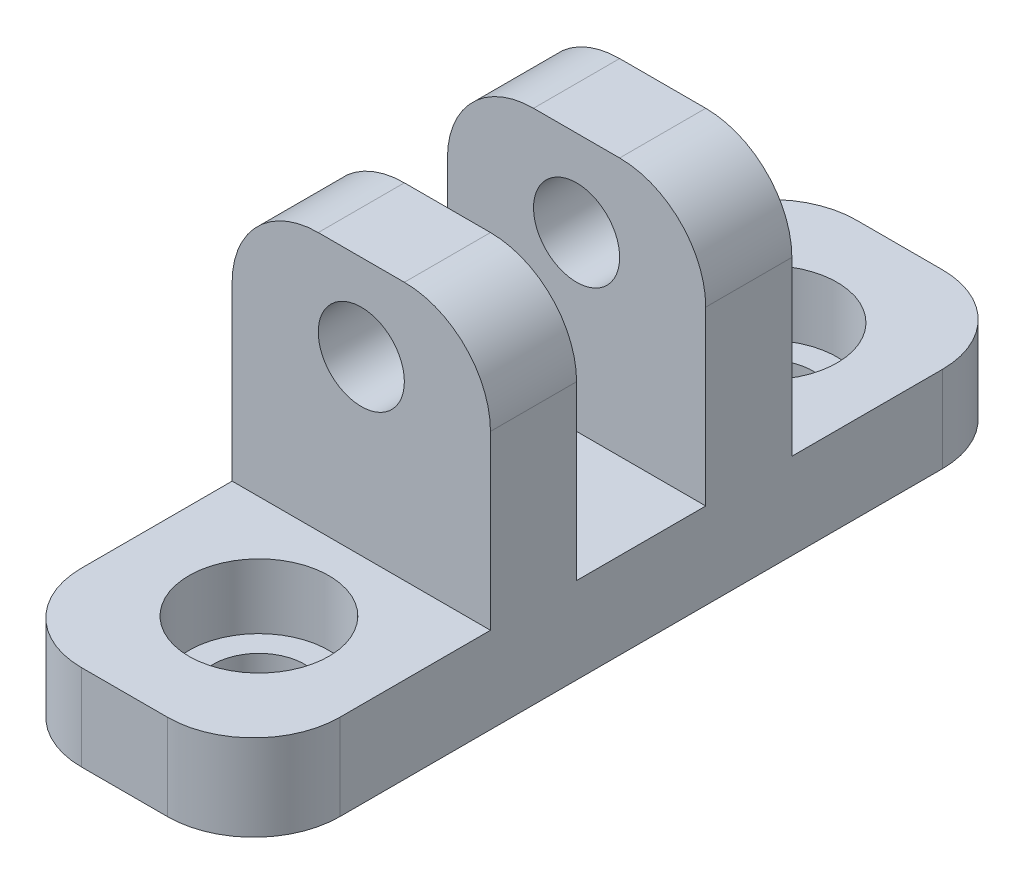
ISO-10303-21;
HEADER;
FILE_DESCRIPTION(('STEP AP214'),'2;1');
FILE_NAME('part.step','',(''),(''),'','','');
FILE_SCHEMA(('AUTOMOTIVE_DESIGN { 1 0 10303 214 1 1 1 1 }'));
ENDSEC;
DATA;
#1=APPLICATION_CONTEXT('core data for automotive mechanical design processes');
#2=APPLICATION_PROTOCOL_DEFINITION('international standard','automotive_design',2000,#1);
#3=PRODUCT_CONTEXT('',#1,'mechanical');
#4=PRODUCT('Part','Part','',(#3));
#5=PRODUCT_RELATED_PRODUCT_CATEGORY('part','',(#4));
#6=PRODUCT_DEFINITION_FORMATION('','',#4);
#7=PRODUCT_DEFINITION_CONTEXT('part definition',#1,'design');
#8=PRODUCT_DEFINITION('design','',#6,#7);
#9=PRODUCT_DEFINITION_SHAPE('','',#8);
#10=(LENGTH_UNIT() NAMED_UNIT(*) SI_UNIT(.MILLI.,.METRE.));
#11=(NAMED_UNIT(*) PLANE_ANGLE_UNIT() SI_UNIT($,.RADIAN.));
#12=(NAMED_UNIT(*) SI_UNIT($,.STERADIAN.) SOLID_ANGLE_UNIT());
#13=UNCERTAINTY_MEASURE_WITH_UNIT(LENGTH_MEASURE(1.E-05),#10,'distance_accuracy_value','');
#14=(GEOMETRIC_REPRESENTATION_CONTEXT(3) GLOBAL_UNCERTAINTY_ASSIGNED_CONTEXT((#13)) GLOBAL_UNIT_ASSIGNED_CONTEXT((#10,
#11,#12)) REPRESENTATION_CONTEXT('',''));
#15=CARTESIAN_POINT('',(0.,0.,0.));
#16=DIRECTION('',(0.,0.,1.));
#17=DIRECTION('',(1.,0.,0.));
#18=AXIS2_PLACEMENT_3D('',#15,#16,#17);
#19=CARTESIAN_POINT('',(60.325,6.35,-28.575));
#20=DIRECTION('',(0.,-1.,0.));
#21=DIRECTION('',(0.,0.,-1.));
#22=AXIS2_PLACEMENT_3D('',#19,#20,#21);
#23=PLANE('',#22);
#24=DIRECTION('',(1.,0.,0.));
#25=VECTOR('',#24,1.);
#26=CARTESIAN_POINT('',(60.325,6.35,-28.575));
#27=LINE('',#26,#25);
#28=CARTESIAN_POINT('',(66.675,6.35,-28.575));
#29=VERTEX_POINT('',#28);
#30=CARTESIAN_POINT('',(73.025,6.35,-28.575));
#31=VERTEX_POINT('',#30);
#32=EDGE_CURVE('E258',#29,#31,#27,.T.);
#33=ORIENTED_EDGE('',*,*,#32,.F.);
#34=CARTESIAN_POINT('',(66.675,6.35,-22.225));
#35=DIRECTION('',(0.,-1.,0.));
#36=DIRECTION('',(0.,0.,-1.));
#37=AXIS2_PLACEMENT_3D('',#34,#35,#36);
#38=CIRCLE('',#37,6.35);
#39=CARTESIAN_POINT('',(60.325,6.35,-22.225));
#40=VERTEX_POINT('',#39);
#41=EDGE_CURVE('E378',#29,#40,#38,.F.);
#42=ORIENTED_EDGE('',*,*,#41,.T.);
#43=DIRECTION('',(0.,0.,-1.));
#44=VECTOR('',#43,1.);
#45=CARTESIAN_POINT('',(60.325,6.35,-28.575));
#46=LINE('',#45,#44);
#47=CARTESIAN_POINT('',(60.325,6.35,-11.1125));
#48=VERTEX_POINT('',#47);
#49=EDGE_CURVE('E278',#48,#40,#46,.T.);
#50=ORIENTED_EDGE('',*,*,#49,.F.);
#51=DIRECTION('',(1.,0.,0.));
#52=VECTOR('',#51,1.);
#53=CARTESIAN_POINT('',(60.325,6.35,-11.1125));
#54=LINE('',#53,#52);
#55=CARTESIAN_POINT('',(79.375,6.35,-11.1125));
#56=VERTEX_POINT('',#55);
#57=EDGE_CURVE('E293',#48,#56,#54,.T.);
#58=ORIENTED_EDGE('',*,*,#57,.T.);
#59=DIRECTION('',(0.,0.,-1.));
#60=VECTOR('',#59,1.);
#61=CARTESIAN_POINT('',(79.375,6.35,-28.575));
#62=LINE('',#61,#60);
#63=CARTESIAN_POINT('',(79.375,6.35,-22.225));
#64=VERTEX_POINT('',#63);
#65=EDGE_CURVE('E279',#56,#64,#62,.T.);
#66=ORIENTED_EDGE('',*,*,#65,.T.);
#67=CARTESIAN_POINT('',(73.025,6.35,-22.225));
#68=DIRECTION('',(0.,-1.,0.));
#69=DIRECTION('',(0.,0.,-1.));
#70=AXIS2_PLACEMENT_3D('',#67,#68,#69);
#71=CIRCLE('',#70,6.35);
#72=EDGE_CURVE('E375',#64,#31,#71,.F.);
#73=ORIENTED_EDGE('',*,*,#72,.T.);
#74=EDGE_LOOP('',(#33,#42,#50,#58,#66,#73));
#75=FACE_BOUND('',#74,.T.);
#76=CARTESIAN_POINT('',(69.9233705650656,6.35,-18.7359106749715));
#77=DIRECTION('',(0.,1.,0.));
#78=DIRECTION('',(0.,0.,1.));
#79=AXIS2_PLACEMENT_3D('',#76,#77,#78);
#80=CIRCLE('',#79,5.15873999999999);
#81=CARTESIAN_POINT('',(69.9233705650656,6.35,-13.5771706749715));
#82=VERTEX_POINT('',#81);
#83=EDGE_CURVE('E797',#82,#82,#80,.T.);
#84=ORIENTED_EDGE('',*,*,#83,.F.);
#85=EDGE_LOOP('',(#84));
#86=FACE_BOUND('',#85,.T.);
#87=ADVANCED_FACE('F41',(#75,#86),#23,.F.);
#88=CARTESIAN_POINT('',(60.325,6.35,28.575));
#89=DIRECTION('',(0.,-1.,0.));
#90=DIRECTION('',(0.,0.,-1.));
#91=AXIS2_PLACEMENT_3D('',#88,#89,#90);
#92=PLANE('',#91);
#93=DIRECTION('',(0.,0.,-1.));
#94=VECTOR('',#93,1.);
#95=CARTESIAN_POINT('',(60.325,6.35,28.575));
#96=LINE('',#95,#94);
#97=CARTESIAN_POINT('',(60.325,6.35,22.225));
#98=VERTEX_POINT('',#97);
#99=CARTESIAN_POINT('',(60.325,6.35,11.1125));
#100=VERTEX_POINT('',#99);
#101=EDGE_CURVE('E300',#98,#100,#96,.T.);
#102=ORIENTED_EDGE('',*,*,#101,.F.);
#103=CARTESIAN_POINT('',(66.675,6.35,22.225));
#104=DIRECTION('',(0.,-1.,0.));
#105=DIRECTION('',(0.,0.,-1.));
#106=AXIS2_PLACEMENT_3D('',#103,#104,#105);
#107=CIRCLE('',#106,6.35);
#108=CARTESIAN_POINT('',(66.675,6.35,28.575));
#109=VERTEX_POINT('',#108);
#110=EDGE_CURVE('E404',#98,#109,#107,.F.);
#111=ORIENTED_EDGE('',*,*,#110,.T.);
#112=DIRECTION('',(1.,0.,0.));
#113=VECTOR('',#112,1.);
#114=CARTESIAN_POINT('',(60.325,6.35,28.575));
#115=LINE('',#114,#113);
#116=CARTESIAN_POINT('',(73.025,6.35,28.575));
#117=VERTEX_POINT('',#116);
#118=EDGE_CURVE('E307',#109,#117,#115,.T.);
#119=ORIENTED_EDGE('',*,*,#118,.T.);
#120=CARTESIAN_POINT('',(73.025,6.35,22.225));
#121=DIRECTION('',(0.,-1.,0.));
#122=DIRECTION('',(0.,0.,-1.));
#123=AXIS2_PLACEMENT_3D('',#120,#121,#122);
#124=CIRCLE('',#123,6.35);
#125=CARTESIAN_POINT('',(79.375,6.35,22.225));
#126=VERTEX_POINT('',#125);
#127=EDGE_CURVE('E401',#117,#126,#124,.F.);
#128=ORIENTED_EDGE('',*,*,#127,.T.);
#129=DIRECTION('',(0.,0.,-1.));
#130=VECTOR('',#129,1.);
#131=CARTESIAN_POINT('',(79.375,6.35,28.575));
#132=LINE('',#131,#130);
#133=CARTESIAN_POINT('',(79.375,6.35,11.1125));
#134=VERTEX_POINT('',#133);
#135=EDGE_CURVE('E268',#126,#134,#132,.T.);
#136=ORIENTED_EDGE('',*,*,#135,.T.);
#137=DIRECTION('',(1.,0.,0.));
#138=VECTOR('',#137,1.);
#139=CARTESIAN_POINT('',(60.325,6.35,11.1125));
#140=LINE('',#139,#138);
#141=EDGE_CURVE('E316',#100,#134,#140,.T.);
#142=ORIENTED_EDGE('',*,*,#141,.F.);
#143=EDGE_LOOP('',(#102,#111,#119,#128,#136,#142));
#144=FACE_BOUND('',#143,.T.);
#145=CARTESIAN_POINT('',(69.9233705650656,6.35,18.7359106749715));
#146=DIRECTION('',(0.,1.,0.));
#147=DIRECTION('',(0.,0.,1.));
#148=AXIS2_PLACEMENT_3D('',#145,#146,#147);
#149=CIRCLE('',#148,5.15873999999999);
#150=CARTESIAN_POINT('',(69.9233705650656,6.35,23.8946506749715));
#151=VERTEX_POINT('',#150);
#152=EDGE_CURVE('E563',#151,#151,#149,.T.);
#153=ORIENTED_EDGE('',*,*,#152,.F.);
#154=EDGE_LOOP('',(#153));
#155=FACE_BOUND('',#154,.T.);
#156=ADVANCED_FACE('F464',(#144,#155),#92,.F.);
#157=CARTESIAN_POINT('',(0.,25.4,0.));
#158=DIRECTION('',(0.,1.,0.));
#159=DIRECTION('',(0.,0.,1.));
#160=AXIS2_PLACEMENT_3D('',#157,#158,#159);
#161=PLANE('',#160);
#162=DIRECTION('',(1.,0.,0.));
#163=VECTOR('',#162,1.);
#164=CARTESIAN_POINT('',(60.325,25.4,4.76249999999999));
#165=LINE('',#164,#163);
#166=CARTESIAN_POINT('',(66.675,25.4,4.76249999999999));
#167=VERTEX_POINT('',#166);
#168=CARTESIAN_POINT('',(73.025,25.4,4.76249999999999));
#169=VERTEX_POINT('',#168);
#170=EDGE_CURVE('E264',#167,#169,#165,.T.);
#171=ORIENTED_EDGE('',*,*,#170,.F.);
#172=DIRECTION('',(0.,0.,1.));
#173=VECTOR('',#172,1.);
#174=CARTESIAN_POINT('',(66.675,25.4,11.1125));
#175=LINE('',#174,#173);
#176=CARTESIAN_POINT('',(66.675,25.4,11.1125));
#177=VERTEX_POINT('',#176);
#178=EDGE_CURVE('E431',#167,#177,#175,.T.);
#179=ORIENTED_EDGE('',*,*,#178,.T.);
#180=DIRECTION('',(1.,0.,0.));
#181=VECTOR('',#180,1.);
#182=CARTESIAN_POINT('',(60.325,25.4,11.1125));
#183=LINE('',#182,#181);
#184=CARTESIAN_POINT('',(73.025,25.4,11.1125));
#185=VERTEX_POINT('',#184);
#186=EDGE_CURVE('E312',#177,#185,#183,.T.);
#187=ORIENTED_EDGE('',*,*,#186,.T.);
#188=DIRECTION('',(0.,0.,-1.));
#189=VECTOR('',#188,1.);
#190=CARTESIAN_POINT('',(73.025,25.4,4.76249999999999));
#191=LINE('',#190,#189);
#192=EDGE_CURVE('E427',#185,#169,#191,.T.);
#193=ORIENTED_EDGE('',*,*,#192,.T.);
#194=EDGE_LOOP('',(#171,#179,#187,#193));
#195=FACE_BOUND('',#194,.T.);
#196=ADVANCED_FACE('F447',(#195),#161,.T.);
#197=CARTESIAN_POINT('',(60.325,25.4,-28.575));
#198=DIRECTION('',(1.,0.,0.));
#199=DIRECTION('',(0.,0.,-1.));
#200=AXIS2_PLACEMENT_3D('',#197,#198,#199);
#201=PLANE('',#200);
#202=ORIENTED_EDGE('',*,*,#49,.T.);
#203=DIRECTION('',(0.,-1.,0.));
#204=VECTOR('',#203,1.);
#205=CARTESIAN_POINT('',(60.325,25.4,-22.225));
#206=LINE('',#205,#204);
#207=CARTESIAN_POINT('',(60.325,0.,-22.225));
#208=VERTEX_POINT('',#207);
#209=EDGE_CURVE('E352',#40,#208,#206,.T.);
#210=ORIENTED_EDGE('',*,*,#209,.T.);
#211=DIRECTION('',(0.,0.,1.));
#212=VECTOR('',#211,1.);
#213=CARTESIAN_POINT('',(60.325,0.,-28.575));
#214=LINE('',#213,#212);
#215=CARTESIAN_POINT('',(60.325,0.,22.225));
#216=VERTEX_POINT('',#215);
#217=EDGE_CURVE('E315',#208,#216,#214,.T.);
#218=ORIENTED_EDGE('',*,*,#217,.T.);
#219=DIRECTION('',(0.,-1.,0.));
#220=VECTOR('',#219,1.);
#221=CARTESIAN_POINT('',(60.325,25.4,22.225));
#222=LINE('',#221,#220);
#223=EDGE_CURVE('E349',#216,#98,#222,.F.);
#224=ORIENTED_EDGE('',*,*,#223,.T.);
#225=ORIENTED_EDGE('',*,*,#101,.T.);
#226=DIRECTION('',(0.,1.,0.));
#227=VECTOR('',#226,1.);
#228=CARTESIAN_POINT('',(60.325,25.4,11.1125));
#229=LINE('',#228,#227);
#230=CARTESIAN_POINT('',(60.325,19.05,11.1125));
#231=VERTEX_POINT('',#230);
#232=EDGE_CURVE('E303',#100,#231,#229,.T.);
#233=ORIENTED_EDGE('',*,*,#232,.T.);
#234=DIRECTION('',(0.,0.,1.));
#235=VECTOR('',#234,1.);
#236=CARTESIAN_POINT('',(60.325,19.05,4.76249999999999));
#237=LINE('',#236,#235);
#238=CARTESIAN_POINT('',(60.325,19.05,4.7625));
#239=VERTEX_POINT('',#238);
#240=EDGE_CURVE('E229',#231,#239,#237,.F.);
#241=ORIENTED_EDGE('',*,*,#240,.T.);
#242=DIRECTION('',(0.,-1.,0.));
#243=VECTOR('',#242,1.);
#244=CARTESIAN_POINT('',(60.325,25.4,4.76249999999999));
#245=LINE('',#244,#243);
#246=CARTESIAN_POINT('',(60.325,6.35,4.76250000000004));
#247=VERTEX_POINT('',#246);
#248=EDGE_CURVE('E221',#239,#247,#245,.T.);
#249=ORIENTED_EDGE('',*,*,#248,.T.);
#250=DIRECTION('',(0.,0.,-1.));
#251=VECTOR('',#250,1.);
#252=CARTESIAN_POINT('',(60.325,6.35,4.76250000000004));
#253=LINE('',#252,#251);
#254=CARTESIAN_POINT('',(60.325,6.35,-4.76249999999996));
#255=VERTEX_POINT('',#254);
#256=EDGE_CURVE('E227',#247,#255,#253,.T.);
#257=ORIENTED_EDGE('',*,*,#256,.T.);
#258=DIRECTION('',(0.,1.,0.));
#259=VECTOR('',#258,1.);
#260=CARTESIAN_POINT('',(60.325,25.4,-4.76250000000001));
#261=LINE('',#260,#259);
#262=CARTESIAN_POINT('',(60.325,19.05,-4.76249999999999));
#263=VERTEX_POINT('',#262);
#264=EDGE_CURVE('E245',#255,#263,#261,.T.);
#265=ORIENTED_EDGE('',*,*,#264,.T.);
#266=DIRECTION('',(0.,0.,1.));
#267=VECTOR('',#266,1.);
#268=CARTESIAN_POINT('',(60.325,19.05,-11.1125));
#269=LINE('',#268,#267);
#270=CARTESIAN_POINT('',(60.325,19.05,-11.1125));
#271=VERTEX_POINT('',#270);
#272=EDGE_CURVE('E346',#263,#271,#269,.F.);
#273=ORIENTED_EDGE('',*,*,#272,.T.);
#274=DIRECTION('',(0.,-1.,0.));
#275=VECTOR('',#274,1.);
#276=CARTESIAN_POINT('',(60.325,25.4,-11.1125));
#277=LINE('',#276,#275);
#278=EDGE_CURVE('E275',#271,#48,#277,.T.);
#279=ORIENTED_EDGE('',*,*,#278,.T.);
#280=EDGE_LOOP('',(#202,#210,#218,#224,#225,#233,#241,#249,#257,#265,#273,#279));
#281=FACE_BOUND('',#280,.T.);
#282=ADVANCED_FACE('F224',(#281),#201,.F.);
#283=CARTESIAN_POINT('',(60.325,25.4,28.575));
#284=DIRECTION('',(0.,0.,-1.));
#285=DIRECTION('',(-1.,0.,0.));
#286=AXIS2_PLACEMENT_3D('',#283,#284,#285);
#287=PLANE('',#286);
#288=ORIENTED_EDGE('',*,*,#118,.F.);
#289=DIRECTION('',(0.,-1.,0.));
#290=VECTOR('',#289,1.);
#291=CARTESIAN_POINT('',(66.675,25.4,28.575));
#292=LINE('',#291,#290);
#293=CARTESIAN_POINT('',(66.675,0.,28.575));
#294=VERTEX_POINT('',#293);
#295=EDGE_CURVE('E397',#109,#294,#292,.T.);
#296=ORIENTED_EDGE('',*,*,#295,.T.);
#297=DIRECTION('',(1.,0.,0.));
#298=VECTOR('',#297,1.);
#299=CARTESIAN_POINT('',(60.325,0.,28.575));
#300=LINE('',#299,#298);
#301=CARTESIAN_POINT('',(73.025,0.,28.575));
#302=VERTEX_POINT('',#301);
#303=EDGE_CURVE('E326',#294,#302,#300,.T.);
#304=ORIENTED_EDGE('',*,*,#303,.T.);
#305=DIRECTION('',(0.,-1.,0.));
#306=VECTOR('',#305,1.);
#307=CARTESIAN_POINT('',(73.025,25.4,28.575));
#308=LINE('',#307,#306);
#309=EDGE_CURVE('E394',#302,#117,#308,.F.);
#310=ORIENTED_EDGE('',*,*,#309,.T.);
#311=EDGE_LOOP('',(#288,#296,#304,#310));
#312=FACE_BOUND('',#311,.T.);
#313=ADVANCED_FACE('F498',(#312),#287,.F.);
#314=CARTESIAN_POINT('',(79.375,25.4,-28.575));
#315=DIRECTION('',(-1.,0.,0.));
#316=DIRECTION('',(0.,0.,1.));
#317=AXIS2_PLACEMENT_3D('',#314,#315,#316);
#318=PLANE('',#317);
#319=DIRECTION('',(0.,0.,-1.));
#320=VECTOR('',#319,1.);
#321=CARTESIAN_POINT('',(79.375,0.,-28.575));
#322=LINE('',#321,#320);
#323=CARTESIAN_POINT('',(79.375,0.,22.225));
#324=VERTEX_POINT('',#323);
#325=CARTESIAN_POINT('',(79.375,0.,-22.225));
#326=VERTEX_POINT('',#325);
#327=EDGE_CURVE('E330',#324,#326,#322,.T.);
#328=ORIENTED_EDGE('',*,*,#327,.T.);
#329=DIRECTION('',(0.,-1.,0.));
#330=VECTOR('',#329,1.);
#331=CARTESIAN_POINT('',(79.375,25.4,-22.225));
#332=LINE('',#331,#330);
#333=EDGE_CURVE('E391',#326,#64,#332,.F.);
#334=ORIENTED_EDGE('',*,*,#333,.T.);
#335=ORIENTED_EDGE('',*,*,#65,.F.);
#336=DIRECTION('',(0.,-1.,0.));
#337=VECTOR('',#336,1.);
#338=CARTESIAN_POINT('',(79.375,25.4,-11.1125));
#339=LINE('',#338,#337);
#340=CARTESIAN_POINT('',(79.375,19.05,-11.1125));
#341=VERTEX_POINT('',#340);
#342=EDGE_CURVE('E283',#341,#56,#339,.T.);
#343=ORIENTED_EDGE('',*,*,#342,.F.);
#344=DIRECTION('',(0.,0.,-1.));
#345=VECTOR('',#344,1.);
#346=CARTESIAN_POINT('',(79.375,19.05,-4.76250000000001));
#347=LINE('',#346,#345);
#348=CARTESIAN_POINT('',(79.375,19.05,-4.76249999999999));
#349=VERTEX_POINT('',#348);
#350=EDGE_CURVE('E384',#341,#349,#347,.F.);
#351=ORIENTED_EDGE('',*,*,#350,.T.);
#352=DIRECTION('',(0.,1.,0.));
#353=VECTOR('',#352,1.);
#354=CARTESIAN_POINT('',(79.375,25.4,-4.76250000000001));
#355=LINE('',#354,#353);
#356=CARTESIAN_POINT('',(79.375,6.35,-4.76249999999996));
#357=VERTEX_POINT('',#356);
#358=EDGE_CURVE('E233',#357,#349,#355,.T.);
#359=ORIENTED_EDGE('',*,*,#358,.F.);
#360=DIRECTION('',(0.,0.,-1.));
#361=VECTOR('',#360,1.);
#362=CARTESIAN_POINT('',(79.375,6.35,4.76250000000004));
#363=LINE('',#362,#361);
#364=CARTESIAN_POINT('',(79.375,6.35,4.76250000000004));
#365=VERTEX_POINT('',#364);
#366=EDGE_CURVE('E257',#365,#357,#363,.T.);
#367=ORIENTED_EDGE('',*,*,#366,.F.);
#368=DIRECTION('',(0.,-1.,0.));
#369=VECTOR('',#368,1.);
#370=CARTESIAN_POINT('',(79.375,25.4,4.76249999999999));
#371=LINE('',#370,#369);
#372=CARTESIAN_POINT('',(79.375,19.05,4.7625));
#373=VERTEX_POINT('',#372);
#374=EDGE_CURVE('E239',#373,#365,#371,.T.);
#375=ORIENTED_EDGE('',*,*,#374,.F.);
#376=DIRECTION('',(0.,0.,-1.));
#377=VECTOR('',#376,1.);
#378=CARTESIAN_POINT('',(79.375,19.05,11.1125));
#379=LINE('',#378,#377);
#380=CARTESIAN_POINT('',(79.375,19.05,11.1125));
#381=VERTEX_POINT('',#380);
#382=EDGE_CURVE('E381',#373,#381,#379,.F.);
#383=ORIENTED_EDGE('',*,*,#382,.T.);
#384=DIRECTION('',(0.,1.,0.));
#385=VECTOR('',#384,1.);
#386=CARTESIAN_POINT('',(79.375,25.4,11.1125));
#387=LINE('',#386,#385);
#388=EDGE_CURVE('E304',#134,#381,#387,.T.);
#389=ORIENTED_EDGE('',*,*,#388,.F.);
#390=ORIENTED_EDGE('',*,*,#135,.F.);
#391=DIRECTION('',(0.,-1.,0.));
#392=VECTOR('',#391,1.);
#393=CARTESIAN_POINT('',(79.375,25.4,22.225));
#394=LINE('',#393,#392);
#395=EDGE_CURVE('E387',#126,#324,#394,.T.);
#396=ORIENTED_EDGE('',*,*,#395,.T.);
#397=EDGE_LOOP('',(#328,#334,#335,#343,#351,#359,#367,#375,#383,#389,#390,#396));
#398=FACE_BOUND('',#397,.T.);
#399=ADVANCED_FACE('F443',(#398),#318,.F.);
#400=CARTESIAN_POINT('',(60.325,25.4,-28.575));
#401=DIRECTION('',(0.,0.,1.));
#402=DIRECTION('',(1.,0.,0.));
#403=AXIS2_PLACEMENT_3D('',#400,#401,#402);
#404=PLANE('',#403);
#405=DIRECTION('',(-1.,0.,0.));
#406=VECTOR('',#405,1.);
#407=CARTESIAN_POINT('',(60.325,0.,-28.575));
#408=LINE('',#407,#406);
#409=CARTESIAN_POINT('',(73.025,0.,-28.575));
#410=VERTEX_POINT('',#409);
#411=CARTESIAN_POINT('',(66.675,0.,-28.575));
#412=VERTEX_POINT('',#411);
#413=EDGE_CURVE('E334',#410,#412,#408,.T.);
#414=ORIENTED_EDGE('',*,*,#413,.T.);
#415=DIRECTION('',(0.,-1.,0.));
#416=VECTOR('',#415,1.);
#417=CARTESIAN_POINT('',(66.675,25.4,-28.575));
#418=LINE('',#417,#416);
#419=EDGE_CURVE('E372',#412,#29,#418,.F.);
#420=ORIENTED_EDGE('',*,*,#419,.T.);
#421=ORIENTED_EDGE('',*,*,#32,.T.);
#422=DIRECTION('',(0.,-1.,0.));
#423=VECTOR('',#422,1.);
#424=CARTESIAN_POINT('',(73.025,25.4,-28.575));
#425=LINE('',#424,#423);
#426=EDGE_CURVE('E368',#31,#410,#425,.T.);
#427=ORIENTED_EDGE('',*,*,#426,.T.);
#428=EDGE_LOOP('',(#414,#420,#421,#427));
#429=FACE_BOUND('',#428,.T.);
#430=ADVANCED_FACE('F488',(#429),#404,.F.);
#431=DIRECTION('',(1.,0.,0.));
#432=VECTOR('',#431,1.);
#433=CARTESIAN_POINT('',(60.325,25.4,-4.76250000000001));
#434=LINE('',#433,#432);
#435=CARTESIAN_POINT('',(66.675,25.4,-4.76250000000001));
#436=VERTEX_POINT('',#435);
#437=CARTESIAN_POINT('',(73.025,25.4,-4.76250000000001));
#438=VERTEX_POINT('',#437);
#439=EDGE_CURVE('E269',#436,#438,#434,.T.);
#440=ORIENTED_EDGE('',*,*,#439,.T.);
#441=DIRECTION('',(0.,0.,-1.));
#442=VECTOR('',#441,1.);
#443=CARTESIAN_POINT('',(73.025,25.4,-11.1125));
#444=LINE('',#443,#442);
#445=CARTESIAN_POINT('',(73.025,25.4,-11.1125));
#446=VERTEX_POINT('',#445);
#447=EDGE_CURVE('E411',#438,#446,#444,.T.);
#448=ORIENTED_EDGE('',*,*,#447,.T.);
#449=DIRECTION('',(1.,0.,0.));
#450=VECTOR('',#449,1.);
#451=CARTESIAN_POINT('',(60.325,25.4,-11.1125));
#452=LINE('',#451,#450);
#453=CARTESIAN_POINT('',(66.675,25.4,-11.1125));
#454=VERTEX_POINT('',#453);
#455=EDGE_CURVE('E282',#454,#446,#452,.T.);
#456=ORIENTED_EDGE('',*,*,#455,.F.);
#457=DIRECTION('',(0.,0.,1.));
#458=VECTOR('',#457,1.);
#459=CARTESIAN_POINT('',(66.675,25.4,-4.76250000000001));
#460=LINE('',#459,#458);
#461=EDGE_CURVE('E407',#454,#436,#460,.T.);
#462=ORIENTED_EDGE('',*,*,#461,.T.);
#463=EDGE_LOOP('',(#440,#448,#456,#462));
#464=FACE_BOUND('',#463,.T.);
#465=ADVANCED_FACE('F485',(#464),#161,.T.);
#466=CARTESIAN_POINT('',(0.,0.,0.));
#467=DIRECTION('',(0.,1.,0.));
#468=DIRECTION('',(0.,0.,1.));
#469=AXIS2_PLACEMENT_3D('',#466,#467,#468);
#470=PLANE('',#469);
#471=CARTESIAN_POINT('',(69.9233705650656,0.,-18.7359106749715));
#472=DIRECTION('',(0.,1.,0.));
#473=DIRECTION('',(0.,0.,1.));
#474=AXIS2_PLACEMENT_3D('',#471,#472,#473);
#475=CIRCLE('',#474,3.37820000000001);
#476=CARTESIAN_POINT('',(69.9233705650656,0.,-15.3577106749715));
#477=VERTEX_POINT('',#476);
#478=EDGE_CURVE('E567',#477,#477,#475,.T.);
#479=ORIENTED_EDGE('',*,*,#478,.T.);
#480=EDGE_LOOP('',(#479));
#481=FACE_BOUND('',#480,.T.);
#482=CARTESIAN_POINT('',(69.9233705650656,0.,18.7359106749715));
#483=DIRECTION('',(0.,1.,0.));
#484=DIRECTION('',(0.,0.,1.));
#485=AXIS2_PLACEMENT_3D('',#482,#483,#484);
#486=CIRCLE('',#485,3.37820000000001);
#487=CARTESIAN_POINT('',(69.9233705650656,0.,22.1141106749715));
#488=VERTEX_POINT('',#487);
#489=EDGE_CURVE('E583',#488,#488,#486,.T.);
#490=ORIENTED_EDGE('',*,*,#489,.T.);
#491=EDGE_LOOP('',(#490));
#492=FACE_BOUND('',#491,.T.);
#493=ORIENTED_EDGE('',*,*,#217,.F.);
#494=CARTESIAN_POINT('',(66.675,0.,-22.225));
#495=DIRECTION('',(0.,1.,0.));
#496=DIRECTION('',(0.,0.,1.));
#497=AXIS2_PLACEMENT_3D('',#494,#495,#496);
#498=CIRCLE('',#497,6.35);
#499=EDGE_CURVE('E365',#208,#412,#498,.F.);
#500=ORIENTED_EDGE('',*,*,#499,.T.);
#501=ORIENTED_EDGE('',*,*,#413,.F.);
#502=CARTESIAN_POINT('',(73.025,0.,-22.225));
#503=DIRECTION('',(0.,1.,0.));
#504=DIRECTION('',(0.,0.,1.));
#505=AXIS2_PLACEMENT_3D('',#502,#503,#504);
#506=CIRCLE('',#505,6.35);
#507=EDGE_CURVE('E362',#410,#326,#506,.F.);
#508=ORIENTED_EDGE('',*,*,#507,.T.);
#509=ORIENTED_EDGE('',*,*,#327,.F.);
#510=CARTESIAN_POINT('',(73.025,0.,22.225));
#511=DIRECTION('',(0.,1.,0.));
#512=DIRECTION('',(0.,0.,1.));
#513=AXIS2_PLACEMENT_3D('',#510,#511,#512);
#514=CIRCLE('',#513,6.35);
#515=EDGE_CURVE('E356',#324,#302,#514,.F.);
#516=ORIENTED_EDGE('',*,*,#515,.T.);
#517=ORIENTED_EDGE('',*,*,#303,.F.);
#518=CARTESIAN_POINT('',(66.675,0.,22.225));
#519=DIRECTION('',(0.,1.,0.));
#520=DIRECTION('',(0.,0.,1.));
#521=AXIS2_PLACEMENT_3D('',#518,#519,#520);
#522=CIRCLE('',#521,6.35);
#523=EDGE_CURVE('E359',#294,#216,#522,.F.);
#524=ORIENTED_EDGE('',*,*,#523,.T.);
#525=EDGE_LOOP('',(#493,#500,#501,#508,#509,#516,#517,#524));
#526=FACE_BOUND('',#525,.T.);
#527=ADVANCED_FACE('F482',(#481,#492,#526),#470,.F.);
#528=CARTESIAN_POINT('',(60.325,25.4,11.1125));
#529=DIRECTION('',(0.,0.,-1.));
#530=DIRECTION('',(0.,1.,0.));
#531=AXIS2_PLACEMENT_3D('',#528,#529,#530);
#532=PLANE('',#531);
#533=CARTESIAN_POINT('',(69.85,19.05,11.1125000000001));
#534=DIRECTION('',(0.,0.,1.));
#535=DIRECTION('',(1.,0.,0.));
#536=AXIS2_PLACEMENT_3D('',#533,#534,#535);
#537=CIRCLE('',#536,3.175);
#538=CARTESIAN_POINT('',(73.025,19.05,11.1125000000001));
#539=VERTEX_POINT('',#538);
#540=EDGE_CURVE('E343',#539,#539,#537,.T.);
#541=ORIENTED_EDGE('',*,*,#540,.F.);
#542=EDGE_LOOP('',(#541));
#543=FACE_BOUND('',#542,.T.);
#544=ORIENTED_EDGE('',*,*,#186,.F.);
#545=CARTESIAN_POINT('',(66.675,19.05,11.1125));
#546=DIRECTION('',(0.,0.,-1.));
#547=DIRECTION('',(0.,1.,0.));
#548=AXIS2_PLACEMENT_3D('',#545,#546,#547);
#549=CIRCLE('',#548,6.35);
#550=EDGE_CURVE('E70',#177,#231,#549,.F.);
#551=ORIENTED_EDGE('',*,*,#550,.T.);
#552=ORIENTED_EDGE('',*,*,#232,.F.);
#553=ORIENTED_EDGE('',*,*,#141,.T.);
#554=ORIENTED_EDGE('',*,*,#388,.T.);
#555=CARTESIAN_POINT('',(73.025,19.05,11.1125));
#556=DIRECTION('',(0.,0.,-1.));
#557=DIRECTION('',(0.,1.,0.));
#558=AXIS2_PLACEMENT_3D('',#555,#556,#557);
#559=CIRCLE('',#558,6.35);
#560=EDGE_CURVE('E60',#381,#185,#559,.F.);
#561=ORIENTED_EDGE('',*,*,#560,.T.);
#562=EDGE_LOOP('',(#544,#551,#552,#553,#554,#561));
#563=FACE_BOUND('',#562,.T.);
#564=ADVANCED_FACE('F448',(#543,#563),#532,.F.);
#565=CARTESIAN_POINT('',(60.325,25.4,-11.1125));
#566=DIRECTION('',(0.,0.,1.));
#567=DIRECTION('',(0.,-1.,0.));
#568=AXIS2_PLACEMENT_3D('',#565,#566,#567);
#569=PLANE('',#568);
#570=CARTESIAN_POINT('',(69.85,19.05,-11.1125));
#571=DIRECTION('',(0.,0.,1.));
#572=DIRECTION('',(0.,-1.,0.));
#573=AXIS2_PLACEMENT_3D('',#570,#571,#572);
#574=CIRCLE('',#573,3.175);
#575=CARTESIAN_POINT('',(69.85,15.875,-11.1125));
#576=VERTEX_POINT('',#575);
#577=EDGE_CURVE('E286',#576,#576,#574,.T.);
#578=ORIENTED_EDGE('',*,*,#577,.T.);
#579=EDGE_LOOP('',(#578));
#580=FACE_BOUND('',#579,.T.);
#581=ORIENTED_EDGE('',*,*,#455,.T.);
#582=CARTESIAN_POINT('',(73.025,19.05,-11.1125));
#583=DIRECTION('',(0.,0.,1.));
#584=DIRECTION('',(0.,-1.,0.));
#585=AXIS2_PLACEMENT_3D('',#582,#583,#584);
#586=CIRCLE('',#585,6.35);
#587=EDGE_CURVE('E418',#446,#341,#586,.F.);
#588=ORIENTED_EDGE('',*,*,#587,.T.);
#589=ORIENTED_EDGE('',*,*,#342,.T.);
#590=ORIENTED_EDGE('',*,*,#57,.F.);
#591=ORIENTED_EDGE('',*,*,#278,.F.);
#592=CARTESIAN_POINT('',(66.675,19.05,-11.1125));
#593=DIRECTION('',(0.,0.,1.));
#594=DIRECTION('',(0.,-1.,0.));
#595=AXIS2_PLACEMENT_3D('',#592,#593,#594);
#596=CIRCLE('',#595,6.35);
#597=EDGE_CURVE('E415',#271,#454,#596,.F.);
#598=ORIENTED_EDGE('',*,*,#597,.T.);
#599=EDGE_LOOP('',(#581,#588,#589,#590,#591,#598));
#600=FACE_BOUND('',#599,.T.);
#601=ADVANCED_FACE('F477',(#580,#600),#569,.F.);
#602=CARTESIAN_POINT('',(60.325,25.4,4.76249999999999));
#603=DIRECTION('',(0.,0.,1.));
#604=DIRECTION('',(0.,-1.,0.));
#605=AXIS2_PLACEMENT_3D('',#602,#603,#604);
#606=PLANE('',#605);
#607=CARTESIAN_POINT('',(69.85,19.05,4.7625));
#608=DIRECTION('',(0.,0.,1.));
#609=DIRECTION('',(0.,-1.,0.));
#610=AXIS2_PLACEMENT_3D('',#607,#608,#609);
#611=CIRCLE('',#610,3.175);
#612=CARTESIAN_POINT('',(69.85,15.875,4.76250000000001));
#613=VERTEX_POINT('',#612);
#614=EDGE_CURVE('E342',#613,#613,#611,.T.);
#615=ORIENTED_EDGE('',*,*,#614,.T.);
#616=EDGE_LOOP('',(#615));
#617=FACE_BOUND('',#616,.T.);
#618=ORIENTED_EDGE('',*,*,#248,.F.);
#619=CARTESIAN_POINT('',(66.675,19.05,4.7625));
#620=DIRECTION('',(0.,0.,1.));
#621=DIRECTION('',(0.,-1.,0.));
#622=AXIS2_PLACEMENT_3D('',#619,#620,#621);
#623=CIRCLE('',#622,6.35);
#624=EDGE_CURVE('E11',#239,#167,#623,.F.);
#625=ORIENTED_EDGE('',*,*,#624,.T.);
#626=ORIENTED_EDGE('',*,*,#170,.T.);
#627=CARTESIAN_POINT('',(73.025,19.05,4.7625));
#628=DIRECTION('',(0.,0.,1.));
#629=DIRECTION('',(0.,-1.,0.));
#630=AXIS2_PLACEMENT_3D('',#627,#628,#629);
#631=CIRCLE('',#630,6.35);
#632=EDGE_CURVE('E50',#169,#373,#631,.F.);
#633=ORIENTED_EDGE('',*,*,#632,.T.);
#634=ORIENTED_EDGE('',*,*,#374,.T.);
#635=DIRECTION('',(1.,0.,0.));
#636=VECTOR('',#635,1.);
#637=CARTESIAN_POINT('',(60.325,6.35,4.76250000000004));
#638=LINE('',#637,#636);
#639=EDGE_CURVE('E236',#247,#365,#638,.T.);
#640=ORIENTED_EDGE('',*,*,#639,.F.);
#641=EDGE_LOOP('',(#618,#625,#626,#633,#634,#640));
#642=FACE_BOUND('',#641,.T.);
#643=ADVANCED_FACE('F237',(#617,#642),#606,.F.);
#644=CARTESIAN_POINT('',(60.325,25.4,-4.76250000000001));
#645=DIRECTION('',(0.,0.,-1.));
#646=DIRECTION('',(0.,1.,0.));
#647=AXIS2_PLACEMENT_3D('',#644,#645,#646);
#648=PLANE('',#647);
#649=CARTESIAN_POINT('',(69.85,19.05,-4.7625));
#650=DIRECTION('',(0.,0.,-1.));
#651=DIRECTION('',(0.,1.,0.));
#652=AXIS2_PLACEMENT_3D('',#649,#650,#651);
#653=CIRCLE('',#652,3.175);
#654=CARTESIAN_POINT('',(69.85,22.225,-4.7625));
#655=VERTEX_POINT('',#654);
#656=EDGE_CURVE('E338',#655,#655,#653,.T.);
#657=ORIENTED_EDGE('',*,*,#656,.T.);
#658=EDGE_LOOP('',(#657));
#659=FACE_BOUND('',#658,.T.);
#660=ORIENTED_EDGE('',*,*,#358,.T.);
#661=CARTESIAN_POINT('',(73.025,19.05,-4.76249999999999));
#662=DIRECTION('',(0.,0.,-1.));
#663=DIRECTION('',(0.,1.,0.));
#664=AXIS2_PLACEMENT_3D('',#661,#662,#663);
#665=CIRCLE('',#664,6.35);
#666=EDGE_CURVE('E424',#349,#438,#665,.F.);
#667=ORIENTED_EDGE('',*,*,#666,.T.);
#668=ORIENTED_EDGE('',*,*,#439,.F.);
#669=CARTESIAN_POINT('',(66.675,19.05,-4.76249999999999));
#670=DIRECTION('',(0.,0.,-1.));
#671=DIRECTION('',(0.,1.,0.));
#672=AXIS2_PLACEMENT_3D('',#669,#670,#671);
#673=CIRCLE('',#672,6.35);
#674=EDGE_CURVE('E421',#436,#263,#673,.F.);
#675=ORIENTED_EDGE('',*,*,#674,.T.);
#676=ORIENTED_EDGE('',*,*,#264,.F.);
#677=DIRECTION('',(1.,0.,0.));
#678=VECTOR('',#677,1.);
#679=CARTESIAN_POINT('',(60.325,6.35,-4.76249999999996));
#680=LINE('',#679,#678);
#681=EDGE_CURVE('E244',#255,#357,#680,.T.);
#682=ORIENTED_EDGE('',*,*,#681,.T.);
#683=EDGE_LOOP('',(#660,#667,#668,#675,#676,#682));
#684=FACE_BOUND('',#683,.T.);
#685=ADVANCED_FACE('F530',(#659,#684),#648,.F.);
#686=CARTESIAN_POINT('',(60.325,6.35,4.76250000000004));
#687=DIRECTION('',(0.,-1.,0.));
#688=DIRECTION('',(0.,0.,-1.));
#689=AXIS2_PLACEMENT_3D('',#686,#687,#688);
#690=PLANE('',#689);
#691=ORIENTED_EDGE('',*,*,#366,.T.);
#692=ORIENTED_EDGE('',*,*,#681,.F.);
#693=ORIENTED_EDGE('',*,*,#256,.F.);
#694=ORIENTED_EDGE('',*,*,#639,.T.);
#695=EDGE_LOOP('',(#691,#692,#693,#694));
#696=FACE_BOUND('',#695,.T.);
#697=ADVANCED_FACE('F247',(#696),#690,.F.);
#698=CARTESIAN_POINT('',(69.85,19.05,-28.575));
#699=DIRECTION('',(0.,0.,1.));
#700=DIRECTION('',(1.,0.,0.));
#701=AXIS2_PLACEMENT_3D('',#698,#699,#700);
#702=CYLINDRICAL_SURFACE('',#701,3.175);
#703=ORIENTED_EDGE('',*,*,#656,.F.);
#704=EDGE_LOOP('',(#703));
#705=FACE_BOUND('',#704,.T.);
#706=ORIENTED_EDGE('',*,*,#577,.F.);
#707=EDGE_LOOP('',(#706));
#708=FACE_BOUND('',#707,.T.);
#709=ADVANCED_FACE('F595',(#705,#708),#702,.F.);
#710=ORIENTED_EDGE('',*,*,#540,.T.);
#711=EDGE_LOOP('',(#710));
#712=FACE_BOUND('',#711,.T.);
#713=ORIENTED_EDGE('',*,*,#614,.F.);
#714=EDGE_LOOP('',(#713));
#715=FACE_BOUND('',#714,.T.);
#716=ADVANCED_FACE('F508',(#712,#715),#702,.F.);
#717=CARTESIAN_POINT('',(66.675,25.4,-22.225));
#718=DIRECTION('',(0.,-1.,0.));
#719=DIRECTION('',(0.,0.,-1.));
#720=AXIS2_PLACEMENT_3D('',#717,#718,#719);
#721=CYLINDRICAL_SURFACE('',#720,6.35);
#722=ORIENTED_EDGE('',*,*,#41,.F.);
#723=ORIENTED_EDGE('',*,*,#419,.F.);
#724=ORIENTED_EDGE('',*,*,#499,.F.);
#725=ORIENTED_EDGE('',*,*,#209,.F.);
#726=EDGE_LOOP('',(#722,#723,#724,#725));
#727=FACE_BOUND('',#726,.T.);
#728=ADVANCED_FACE('F504',(#727),#721,.T.);
#729=CARTESIAN_POINT('',(73.025,25.4,-22.225));
#730=DIRECTION('',(0.,-1.,0.));
#731=DIRECTION('',(0.,0.,-1.));
#732=AXIS2_PLACEMENT_3D('',#729,#730,#731);
#733=CYLINDRICAL_SURFACE('',#732,6.35);
#734=ORIENTED_EDGE('',*,*,#72,.F.);
#735=ORIENTED_EDGE('',*,*,#333,.F.);
#736=ORIENTED_EDGE('',*,*,#507,.F.);
#737=ORIENTED_EDGE('',*,*,#426,.F.);
#738=EDGE_LOOP('',(#734,#735,#736,#737));
#739=FACE_BOUND('',#738,.T.);
#740=ADVANCED_FACE('F507',(#739),#733,.T.);
#741=CARTESIAN_POINT('',(66.675,25.4,22.225));
#742=DIRECTION('',(0.,-1.,0.));
#743=DIRECTION('',(0.,0.,-1.));
#744=AXIS2_PLACEMENT_3D('',#741,#742,#743);
#745=CYLINDRICAL_SURFACE('',#744,6.35);
#746=ORIENTED_EDGE('',*,*,#110,.F.);
#747=ORIENTED_EDGE('',*,*,#223,.F.);
#748=ORIENTED_EDGE('',*,*,#523,.F.);
#749=ORIENTED_EDGE('',*,*,#295,.F.);
#750=EDGE_LOOP('',(#746,#747,#748,#749));
#751=FACE_BOUND('',#750,.T.);
#752=ADVANCED_FACE('F512',(#751),#745,.T.);
#753=CARTESIAN_POINT('',(73.025,25.4,22.225));
#754=DIRECTION('',(0.,-1.,0.));
#755=DIRECTION('',(0.,0.,-1.));
#756=AXIS2_PLACEMENT_3D('',#753,#754,#755);
#757=CYLINDRICAL_SURFACE('',#756,6.35);
#758=ORIENTED_EDGE('',*,*,#127,.F.);
#759=ORIENTED_EDGE('',*,*,#309,.F.);
#760=ORIENTED_EDGE('',*,*,#515,.F.);
#761=ORIENTED_EDGE('',*,*,#395,.F.);
#762=EDGE_LOOP('',(#758,#759,#760,#761));
#763=FACE_BOUND('',#762,.T.);
#764=ADVANCED_FACE('F516',(#763),#757,.T.);
#765=CARTESIAN_POINT('',(73.025,19.05,0.));
#766=DIRECTION('',(0.,0.,1.));
#767=DIRECTION('',(1.,0.,0.));
#768=AXIS2_PLACEMENT_3D('',#765,#766,#767);
#769=CYLINDRICAL_SURFACE('',#768,6.35);
#770=ORIENTED_EDGE('',*,*,#666,.F.);
#771=ORIENTED_EDGE('',*,*,#350,.F.);
#772=ORIENTED_EDGE('',*,*,#587,.F.);
#773=ORIENTED_EDGE('',*,*,#447,.F.);
#774=EDGE_LOOP('',(#770,#771,#772,#773));
#775=FACE_BOUND('',#774,.T.);
#776=ADVANCED_FACE('F460',(#775),#769,.T.);
#777=CARTESIAN_POINT('',(66.675,19.05,0.));
#778=DIRECTION('',(0.,0.,-1.));
#779=DIRECTION('',(-1.,0.,0.));
#780=AXIS2_PLACEMENT_3D('',#777,#778,#779);
#781=CYLINDRICAL_SURFACE('',#780,6.35);
#782=ORIENTED_EDGE('',*,*,#597,.F.);
#783=ORIENTED_EDGE('',*,*,#272,.F.);
#784=ORIENTED_EDGE('',*,*,#674,.F.);
#785=ORIENTED_EDGE('',*,*,#461,.F.);
#786=EDGE_LOOP('',(#782,#783,#784,#785));
#787=FACE_BOUND('',#786,.T.);
#788=ADVANCED_FACE('F454',(#787),#781,.T.);
#789=CARTESIAN_POINT('',(66.675,19.05,0.));
#790=DIRECTION('',(0.,0.,-1.));
#791=DIRECTION('',(-1.,0.,0.));
#792=AXIS2_PLACEMENT_3D('',#789,#790,#791);
#793=CYLINDRICAL_SURFACE('',#792,6.35);
#794=ORIENTED_EDGE('',*,*,#624,.F.);
#795=ORIENTED_EDGE('',*,*,#240,.F.);
#796=ORIENTED_EDGE('',*,*,#550,.F.);
#797=ORIENTED_EDGE('',*,*,#178,.F.);
#798=EDGE_LOOP('',(#794,#795,#796,#797));
#799=FACE_BOUND('',#798,.T.);
#800=ADVANCED_FACE('F452',(#799),#793,.T.);
#801=CARTESIAN_POINT('',(73.025,19.05,0.));
#802=DIRECTION('',(0.,0.,1.));
#803=DIRECTION('',(1.,0.,0.));
#804=AXIS2_PLACEMENT_3D('',#801,#802,#803);
#805=CYLINDRICAL_SURFACE('',#804,6.35);
#806=ORIENTED_EDGE('',*,*,#560,.F.);
#807=ORIENTED_EDGE('',*,*,#382,.F.);
#808=ORIENTED_EDGE('',*,*,#632,.F.);
#809=ORIENTED_EDGE('',*,*,#192,.F.);
#810=EDGE_LOOP('',(#806,#807,#808,#809));
#811=FACE_BOUND('',#810,.T.);
#812=ADVANCED_FACE('F43',(#811),#805,.T.);
#813=CARTESIAN_POINT('',(69.9233705650656,6.35,18.7359106749715));
#814=DIRECTION('',(0.,1.,0.));
#815=DIRECTION('',(0.,0.,1.));
#816=AXIS2_PLACEMENT_3D('',#813,#814,#815);
#817=CYLINDRICAL_SURFACE('',#816,3.37820000000001);
#818=ORIENTED_EDGE('',*,*,#489,.F.);
#819=EDGE_LOOP('',(#818));
#820=FACE_BOUND('',#819,.T.);
#821=CARTESIAN_POINT('',(69.9233705650656,1.5748,18.7359106749715));
#822=DIRECTION('',(0.,1.,0.));
#823=DIRECTION('',(0.,0.,1.));
#824=AXIS2_PLACEMENT_3D('',#821,#822,#823);
#825=CIRCLE('',#824,3.37820000000001);
#826=CARTESIAN_POINT('',(69.9233705650656,1.5748,22.1141106749715));
#827=VERTEX_POINT('',#826);
#828=EDGE_CURVE('E572',#827,#827,#825,.T.);
#829=ORIENTED_EDGE('',*,*,#828,.T.);
#830=EDGE_LOOP('',(#829));
#831=FACE_BOUND('',#830,.T.);
#832=ADVANCED_FACE('F459',(#820,#831),#817,.F.);
#833=CARTESIAN_POINT('',(73.3015705650657,1.5748,18.7359106749715));
#834=DIRECTION('',(0.,-1.,0.));
#835=DIRECTION('',(0.,0.,-1.));
#836=AXIS2_PLACEMENT_3D('',#833,#834,#835);
#837=PLANE('',#836);
#838=ORIENTED_EDGE('',*,*,#828,.F.);
#839=EDGE_LOOP('',(#838));
#840=FACE_BOUND('',#839,.T.);
#841=CARTESIAN_POINT('',(69.9233705650656,1.5748,18.7359106749715));
#842=DIRECTION('',(0.,1.,0.));
#843=DIRECTION('',(0.,0.,1.));
#844=AXIS2_PLACEMENT_3D('',#841,#842,#843);
#845=CIRCLE('',#844,5.15873999999999);
#846=CARTESIAN_POINT('',(69.9233705650656,1.5748,23.8946506749715));
#847=VERTEX_POINT('',#846);
#848=EDGE_CURVE('E566',#847,#847,#845,.T.);
#849=ORIENTED_EDGE('',*,*,#848,.T.);
#850=EDGE_LOOP('',(#849));
#851=FACE_BOUND('',#850,.T.);
#852=ADVANCED_FACE('F742',(#840,#851),#837,.F.);
#853=CARTESIAN_POINT('',(69.9233705650656,6.35,18.7359106749715));
#854=DIRECTION('',(0.,1.,0.));
#855=DIRECTION('',(0.,0.,1.));
#856=AXIS2_PLACEMENT_3D('',#853,#854,#855);
#857=CYLINDRICAL_SURFACE('',#856,5.15873999999999);
#858=ORIENTED_EDGE('',*,*,#848,.F.);
#859=EDGE_LOOP('',(#858));
#860=FACE_BOUND('',#859,.T.);
#861=ORIENTED_EDGE('',*,*,#152,.T.);
#862=EDGE_LOOP('',(#861));
#863=FACE_BOUND('',#862,.T.);
#864=ADVANCED_FACE('F661',(#860,#863),#857,.F.);
#865=CARTESIAN_POINT('',(69.9233705650656,6.35,-18.7359106749715));
#866=DIRECTION('',(0.,1.,0.));
#867=DIRECTION('',(0.,0.,1.));
#868=AXIS2_PLACEMENT_3D('',#865,#866,#867);
#869=CYLINDRICAL_SURFACE('',#868,3.37820000000001);
#870=ORIENTED_EDGE('',*,*,#478,.F.);
#871=EDGE_LOOP('',(#870));
#872=FACE_BOUND('',#871,.T.);
#873=CARTESIAN_POINT('',(69.9233705650656,1.5748,-18.7359106749715));
#874=DIRECTION('',(0.,1.,0.));
#875=DIRECTION('',(0.,0.,1.));
#876=AXIS2_PLACEMENT_3D('',#873,#874,#875);
#877=CIRCLE('',#876,3.37820000000001);
#878=CARTESIAN_POINT('',(69.9233705650656,1.5748,-15.3577106749715));
#879=VERTEX_POINT('',#878);
#880=EDGE_CURVE('E576',#879,#879,#877,.T.);
#881=ORIENTED_EDGE('',*,*,#880,.T.);
#882=EDGE_LOOP('',(#881));
#883=FACE_BOUND('',#882,.T.);
#884=ADVANCED_FACE('F755',(#872,#883),#869,.F.);
#885=CARTESIAN_POINT('',(73.3015705650657,1.5748,-18.7359106749715));
#886=DIRECTION('',(0.,-1.,0.));
#887=DIRECTION('',(0.,0.,-1.));
#888=AXIS2_PLACEMENT_3D('',#885,#886,#887);
#889=PLANE('',#888);
#890=ORIENTED_EDGE('',*,*,#880,.F.);
#891=EDGE_LOOP('',(#890));
#892=FACE_BOUND('',#891,.T.);
#893=CARTESIAN_POINT('',(69.9233705650656,1.5748,-18.7359106749715));
#894=DIRECTION('',(0.,1.,0.));
#895=DIRECTION('',(0.,0.,1.));
#896=AXIS2_PLACEMENT_3D('',#893,#894,#895);
#897=CIRCLE('',#896,5.15873999999999);
#898=CARTESIAN_POINT('',(69.9233705650656,1.5748,-13.5771706749715));
#899=VERTEX_POINT('',#898);
#900=EDGE_CURVE('E794',#899,#899,#897,.T.);
#901=ORIENTED_EDGE('',*,*,#900,.T.);
#902=EDGE_LOOP('',(#901));
#903=FACE_BOUND('',#902,.T.);
#904=ADVANCED_FACE('F764',(#892,#903),#889,.F.);
#905=CARTESIAN_POINT('',(69.9233705650656,6.35,-18.7359106749715));
#906=DIRECTION('',(0.,1.,0.));
#907=DIRECTION('',(0.,0.,1.));
#908=AXIS2_PLACEMENT_3D('',#905,#906,#907);
#909=CYLINDRICAL_SURFACE('',#908,5.15873999999999);
#910=ORIENTED_EDGE('',*,*,#900,.F.);
#911=EDGE_LOOP('',(#910));
#912=FACE_BOUND('',#911,.T.);
#913=ORIENTED_EDGE('',*,*,#83,.T.);
#914=EDGE_LOOP('',(#913));
#915=FACE_BOUND('',#914,.T.);
#916=ADVANCED_FACE('F773',(#912,#915),#909,.F.);
#917=CLOSED_SHELL('',(#87,#156,#196,#282,#313,#399,#430,#465,#527,#564,#601,#643,#685,#697,#709,
#716,#728,#740,#752,#764,#776,#788,#800,#812,#832,#852,#864,#884,#904,#916));
#918=MANIFOLD_SOLID_BREP('B2',#917);
#919=ADVANCED_BREP_SHAPE_REPRESENTATION('',(#18,#918),#14);
#920=SHAPE_DEFINITION_REPRESENTATION(#9,#919);
ENDSEC;
END-ISO-10303-21;
